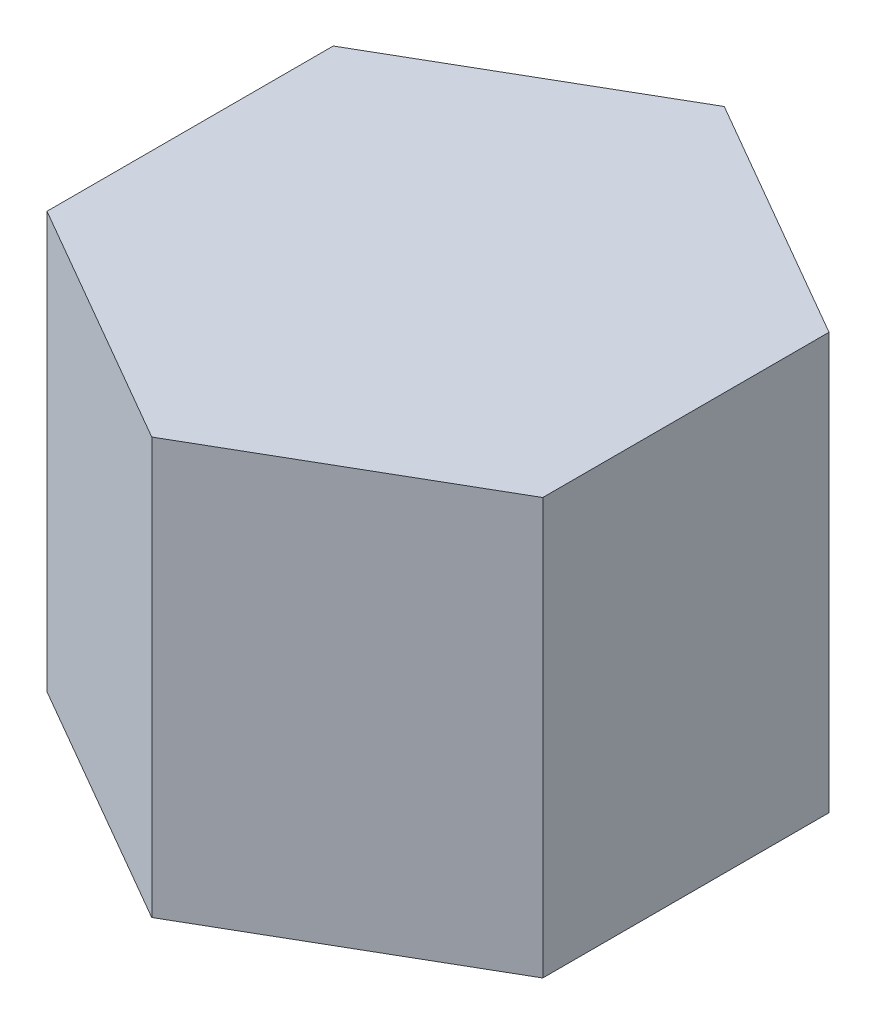
ISO-10303-21;
HEADER;
FILE_DESCRIPTION(('STEP AP214'),'2;1');
FILE_NAME('part.step','',(''),(''),'','','');
FILE_SCHEMA(('AUTOMOTIVE_DESIGN { 1 0 10303 214 1 1 1 1 }'));
ENDSEC;
DATA;
#1=APPLICATION_CONTEXT('core data for automotive mechanical design processes');
#2=APPLICATION_PROTOCOL_DEFINITION('international standard','automotive_design',2000,#1);
#3=PRODUCT_CONTEXT('',#1,'mechanical');
#4=PRODUCT('Part','Part','',(#3));
#5=PRODUCT_RELATED_PRODUCT_CATEGORY('part','',(#4));
#6=PRODUCT_DEFINITION_FORMATION('','',#4);
#7=PRODUCT_DEFINITION_CONTEXT('part definition',#1,'design');
#8=PRODUCT_DEFINITION('design','',#6,#7);
#9=PRODUCT_DEFINITION_SHAPE('','',#8);
#10=(LENGTH_UNIT() NAMED_UNIT(*) SI_UNIT(.MILLI.,.METRE.));
#11=(NAMED_UNIT(*) PLANE_ANGLE_UNIT() SI_UNIT($,.RADIAN.));
#12=(NAMED_UNIT(*) SI_UNIT($,.STERADIAN.) SOLID_ANGLE_UNIT());
#13=UNCERTAINTY_MEASURE_WITH_UNIT(LENGTH_MEASURE(1.E-05),#10,'distance_accuracy_value','');
#14=(GEOMETRIC_REPRESENTATION_CONTEXT(3) GLOBAL_UNCERTAINTY_ASSIGNED_CONTEXT((#13)) GLOBAL_UNIT_ASSIGNED_CONTEXT((#10,
#11,#12)) REPRESENTATION_CONTEXT('',''));
#15=CARTESIAN_POINT('',(0.,0.,0.));
#16=DIRECTION('',(0.,0.,1.));
#17=DIRECTION('',(1.,0.,0.));
#18=AXIS2_PLACEMENT_3D('',#15,#16,#17);
#19=CARTESIAN_POINT('',(209.839551417382,-147.556598747966,289.083895009141));
#20=DIRECTION('',(-0.499999999999978,0.,-0.866025403784452));
#21=DIRECTION('',(-0.866025403784452,0.,0.499999999999978));
#22=AXIS2_PLACEMENT_3D('',#19,#20,#21);
#23=PLANE('',#22);
#24=CARTESIAN_POINT('',(210.142660308706,-147.047793579175,288.908895009141));
#25=DIRECTION('',(-0.866025403784452,0.,0.499999999999978));
#26=VECTOR('',#25,1.);
#27=LINE('',#24,#26);
#28=CARTESIAN_POINT('',(210.142660308706,-147.047793579175,288.908895009141));
#29=VERTEX_POINT('',#28);
#30=CARTESIAN_POINT('',(209.839551417382,-147.047793579175,289.083895009141));
#31=VERTEX_POINT('',#30);
#32=EDGE_CURVE('E170',#29,#31,#27,.T.);
#33=ORIENTED_EDGE('',*,*,#32,.T.);
#34=CARTESIAN_POINT('',(209.839551417382,-147.556598747966,289.083895009141));
#35=DIRECTION('',(0.,1.,0.));
#36=VECTOR('',#35,1.);
#37=LINE('',#34,#36);
#38=CARTESIAN_POINT('',(209.839551417382,-147.556598747966,289.083895009141));
#39=VERTEX_POINT('',#38);
#40=EDGE_CURVE('E35',#39,#31,#37,.T.);
#41=ORIENTED_EDGE('',*,*,#40,.F.);
#42=CARTESIAN_POINT('',(210.142660308706,-147.556598747966,288.908895009141));
#43=DIRECTION('',(-0.866025403784452,0.,0.499999999999978));
#44=VECTOR('',#43,1.);
#45=LINE('',#42,#44);
#46=CARTESIAN_POINT('',(210.142660308706,-147.556598747966,288.908895009141));
#47=VERTEX_POINT('',#46);
#48=EDGE_CURVE('E159',#47,#39,#45,.T.);
#49=ORIENTED_EDGE('',*,*,#48,.F.);
#50=CARTESIAN_POINT('',(210.142660308706,-147.556598747966,288.908895009141));
#51=DIRECTION('',(0.,1.,0.));
#52=VECTOR('',#51,1.);
#53=LINE('',#50,#52);
#54=EDGE_CURVE('E10',#47,#29,#53,.T.);
#55=ORIENTED_EDGE('',*,*,#54,.T.);
#56=EDGE_LOOP('',(#33,#41,#49,#55));
#57=FACE_BOUND('',#56,.T.);
#58=ADVANCED_FACE('F16',(#57),#23,.F.);
#59=CARTESIAN_POINT('',(210.142660308706,-147.556598747966,291.594471220494));
#60=DIRECTION('',(-1.,0.,0.));
#61=DIRECTION('',(0.,-1.,0.));
#62=AXIS2_PLACEMENT_3D('',#59,#60,#61);
#63=PLANE('',#62);
#64=CARTESIAN_POINT('',(210.142660308706,-147.047793579175,288.558895009141));
#65=DIRECTION('',(0.,0.,1.));
#66=VECTOR('',#65,1.);
#67=LINE('',#64,#66);
#68=CARTESIAN_POINT('',(210.142660308706,-147.047793579175,288.558895009141));
#69=VERTEX_POINT('',#68);
#70=EDGE_CURVE('E167',#69,#29,#67,.T.);
#71=ORIENTED_EDGE('',*,*,#70,.T.);
#72=ORIENTED_EDGE('',*,*,#54,.F.);
#73=CARTESIAN_POINT('',(210.142660308706,-147.556598747966,288.558895009141));
#74=DIRECTION('',(0.,0.,1.));
#75=VECTOR('',#74,1.);
#76=LINE('',#73,#75);
#77=CARTESIAN_POINT('',(210.142660308706,-147.556598747966,288.558895009141));
#78=VERTEX_POINT('',#77);
#79=EDGE_CURVE('E156',#78,#47,#76,.T.);
#80=ORIENTED_EDGE('',*,*,#79,.F.);
#81=CARTESIAN_POINT('',(210.142660308706,-147.556598747966,288.558895009141));
#82=DIRECTION('',(0.,1.,0.));
#83=VECTOR('',#82,1.);
#84=LINE('',#81,#83);
#85=EDGE_CURVE('E27',#78,#69,#84,.T.);
#86=ORIENTED_EDGE('',*,*,#85,.T.);
#87=EDGE_LOOP('',(#71,#72,#80,#86));
#88=FACE_BOUND('',#87,.T.);
#89=ADVANCED_FACE('F189',(#88),#63,.F.);
#90=CARTESIAN_POINT('',(210.142660308706,-147.556598747966,288.558895009141));
#91=DIRECTION('',(-0.499999999999943,0.,0.866025403784471));
#92=DIRECTION('',(0.866025403784471,0.,0.499999999999943));
#93=AXIS2_PLACEMENT_3D('',#90,#91,#92);
#94=PLANE('',#93);
#95=CARTESIAN_POINT('',(209.839551417382,-147.047793579175,288.383895009141));
#96=DIRECTION('',(0.866025403784471,0.,0.499999999999943));
#97=VECTOR('',#96,1.);
#98=LINE('',#95,#97);
#99=CARTESIAN_POINT('',(209.839551417382,-147.047793579175,288.383895009141));
#100=VERTEX_POINT('',#99);
#101=EDGE_CURVE('E163',#100,#69,#98,.T.);
#102=ORIENTED_EDGE('',*,*,#101,.T.);
#103=ORIENTED_EDGE('',*,*,#85,.F.);
#104=CARTESIAN_POINT('',(209.839551417382,-147.556598747966,288.383895009141));
#105=DIRECTION('',(0.866025403784471,0.,0.499999999999943));
#106=VECTOR('',#105,1.);
#107=LINE('',#104,#106);
#108=CARTESIAN_POINT('',(209.839551417382,-147.556598747966,288.383895009141));
#109=VERTEX_POINT('',#108);
#110=EDGE_CURVE('E106',#109,#78,#107,.T.);
#111=ORIENTED_EDGE('',*,*,#110,.F.);
#112=CARTESIAN_POINT('',(209.839551417382,-147.556598747966,288.383895009141));
#113=DIRECTION('',(0.,1.,0.));
#114=VECTOR('',#113,1.);
#115=LINE('',#112,#114);
#116=EDGE_CURVE('E94',#109,#100,#115,.T.);
#117=ORIENTED_EDGE('',*,*,#116,.T.);
#118=EDGE_LOOP('',(#102,#103,#111,#117));
#119=FACE_BOUND('',#118,.T.);
#120=ADVANCED_FACE('F198',(#119),#94,.F.);
#121=CARTESIAN_POINT('',(209.839551417382,-147.556598747966,288.383895009141));
#122=DIRECTION('',(0.499999999999978,0.,0.866025403784452));
#123=DIRECTION('',(0.866025403784452,0.,-0.499999999999978));
#124=AXIS2_PLACEMENT_3D('',#121,#122,#123);
#125=PLANE('',#124);
#126=CARTESIAN_POINT('',(209.536442526057,-147.047793579175,288.558895009141));
#127=DIRECTION('',(0.866025403784452,0.,-0.499999999999978));
#128=VECTOR('',#127,1.);
#129=LINE('',#126,#128);
#130=CARTESIAN_POINT('',(209.536442526057,-147.047793579175,288.558895009141));
#131=VERTEX_POINT('',#130);
#132=EDGE_CURVE('E162',#131,#100,#129,.T.);
#133=ORIENTED_EDGE('',*,*,#132,.T.);
#134=ORIENTED_EDGE('',*,*,#116,.F.);
#135=CARTESIAN_POINT('',(209.536442526057,-147.556598747966,288.558895009141));
#136=DIRECTION('',(0.866025403784452,0.,-0.499999999999978));
#137=VECTOR('',#136,1.);
#138=LINE('',#135,#137);
#139=CARTESIAN_POINT('',(209.536442526057,-147.556598747966,288.558895009141));
#140=VERTEX_POINT('',#139);
#141=EDGE_CURVE('E98',#140,#109,#138,.T.);
#142=ORIENTED_EDGE('',*,*,#141,.F.);
#143=CARTESIAN_POINT('',(209.536442526057,-147.556598747966,288.558895009141));
#144=DIRECTION('',(0.,1.,0.));
#145=VECTOR('',#144,1.);
#146=LINE('',#143,#145);
#147=EDGE_CURVE('E79',#140,#131,#146,.T.);
#148=ORIENTED_EDGE('',*,*,#147,.T.);
#149=EDGE_LOOP('',(#133,#134,#142,#148));
#150=FACE_BOUND('',#149,.T.);
#151=ADVANCED_FACE('F100',(#150),#125,.F.);
#152=CARTESIAN_POINT('',(209.536442526057,-147.556598747966,291.594471220494));
#153=DIRECTION('',(1.,0.,0.));
#154=DIRECTION('',(0.,1.,0.));
#155=AXIS2_PLACEMENT_3D('',#152,#153,#154);
#156=PLANE('',#155);
#157=CARTESIAN_POINT('',(209.536442526057,-147.047793579175,288.908895009141));
#158=DIRECTION('',(0.,0.,-1.));
#159=VECTOR('',#158,1.);
#160=LINE('',#157,#159);
#161=CARTESIAN_POINT('',(209.536442526057,-147.047793579175,288.908895009141));
#162=VERTEX_POINT('',#161);
#163=EDGE_CURVE('E88',#162,#131,#160,.T.);
#164=ORIENTED_EDGE('',*,*,#163,.T.);
#165=ORIENTED_EDGE('',*,*,#147,.F.);
#166=CARTESIAN_POINT('',(209.536442526057,-147.556598747966,288.908895009141));
#167=DIRECTION('',(0.,0.,-1.));
#168=VECTOR('',#167,1.);
#169=LINE('',#166,#168);
#170=CARTESIAN_POINT('',(209.536442526057,-147.556598747966,288.908895009141));
#171=VERTEX_POINT('',#170);
#172=EDGE_CURVE('E84',#171,#140,#169,.T.);
#173=ORIENTED_EDGE('',*,*,#172,.F.);
#174=CARTESIAN_POINT('',(209.536442526057,-147.556598747966,288.908895009141));
#175=DIRECTION('',(0.,1.,0.));
#176=VECTOR('',#175,1.);
#177=LINE('',#174,#176);
#178=EDGE_CURVE('E58',#171,#162,#177,.T.);
#179=ORIENTED_EDGE('',*,*,#178,.T.);
#180=EDGE_LOOP('',(#164,#165,#173,#179));
#181=FACE_BOUND('',#180,.T.);
#182=ADVANCED_FACE('F82',(#181),#156,.F.);
#183=CARTESIAN_POINT('',(209.536442526057,-147.556598747966,288.908895009141));
#184=DIRECTION('',(0.499999999999943,0.,-0.866025403784471));
#185=DIRECTION('',(-0.866025403784471,0.,-0.499999999999943));
#186=AXIS2_PLACEMENT_3D('',#183,#184,#185);
#187=PLANE('',#186);
#188=CARTESIAN_POINT('',(209.839551417382,-147.047793579175,289.083895009141));
#189=DIRECTION('',(-0.866025403784471,0.,-0.499999999999943));
#190=VECTOR('',#189,1.);
#191=LINE('',#188,#190);
#192=EDGE_CURVE('E160',#31,#162,#191,.T.);
#193=ORIENTED_EDGE('',*,*,#192,.T.);
#194=ORIENTED_EDGE('',*,*,#178,.F.);
#195=CARTESIAN_POINT('',(209.839551417382,-147.556598747966,289.083895009141));
#196=DIRECTION('',(-0.866025403784471,0.,-0.499999999999943));
#197=VECTOR('',#196,1.);
#198=LINE('',#195,#197);
#199=EDGE_CURVE('E112',#39,#171,#198,.T.);
#200=ORIENTED_EDGE('',*,*,#199,.F.);
#201=ORIENTED_EDGE('',*,*,#40,.T.);
#202=EDGE_LOOP('',(#193,#194,#200,#201));
#203=FACE_BOUND('',#202,.T.);
#204=ADVANCED_FACE('F131',(#203),#187,.F.);
#205=CARTESIAN_POINT('',(206.491105863044,-147.556598747966,291.594471220494));
#206=DIRECTION('',(0.,1.,0.));
#207=DIRECTION('',(-1.,0.,0.));
#208=AXIS2_PLACEMENT_3D('',#205,#206,#207);
#209=PLANE('',#208);
#210=ORIENTED_EDGE('',*,*,#48,.T.);
#211=ORIENTED_EDGE('',*,*,#199,.T.);
#212=ORIENTED_EDGE('',*,*,#172,.T.);
#213=ORIENTED_EDGE('',*,*,#141,.T.);
#214=ORIENTED_EDGE('',*,*,#110,.T.);
#215=ORIENTED_EDGE('',*,*,#79,.T.);
#216=EDGE_LOOP('',(#210,#211,#212,#213,#214,#215));
#217=FACE_BOUND('',#216,.T.);
#218=ADVANCED_FACE('F111',(#217),#209,.F.);
#219=CARTESIAN_POINT('',(206.491105863044,-147.047793579175,291.594471220494));
#220=DIRECTION('',(0.,1.,0.));
#221=DIRECTION('',(-1.,0.,0.));
#222=AXIS2_PLACEMENT_3D('',#219,#220,#221);
#223=PLANE('',#222);
#224=ORIENTED_EDGE('',*,*,#32,.F.);
#225=ORIENTED_EDGE('',*,*,#70,.F.);
#226=ORIENTED_EDGE('',*,*,#101,.F.);
#227=ORIENTED_EDGE('',*,*,#132,.F.);
#228=ORIENTED_EDGE('',*,*,#163,.F.);
#229=ORIENTED_EDGE('',*,*,#192,.F.);
#230=EDGE_LOOP('',(#224,#225,#226,#227,#228,#229));
#231=FACE_BOUND('',#230,.T.);
#232=ADVANCED_FACE('F130',(#231),#223,.T.);
#233=CLOSED_SHELL('',(#58,#89,#120,#151,#182,#204,#218,#232));
#234=MANIFOLD_SOLID_BREP('B1',#233);
#235=ADVANCED_BREP_SHAPE_REPRESENTATION('',(#18,#234),#14);
#236=SHAPE_DEFINITION_REPRESENTATION(#9,#235);
ENDSEC;
END-ISO-10303-21;
